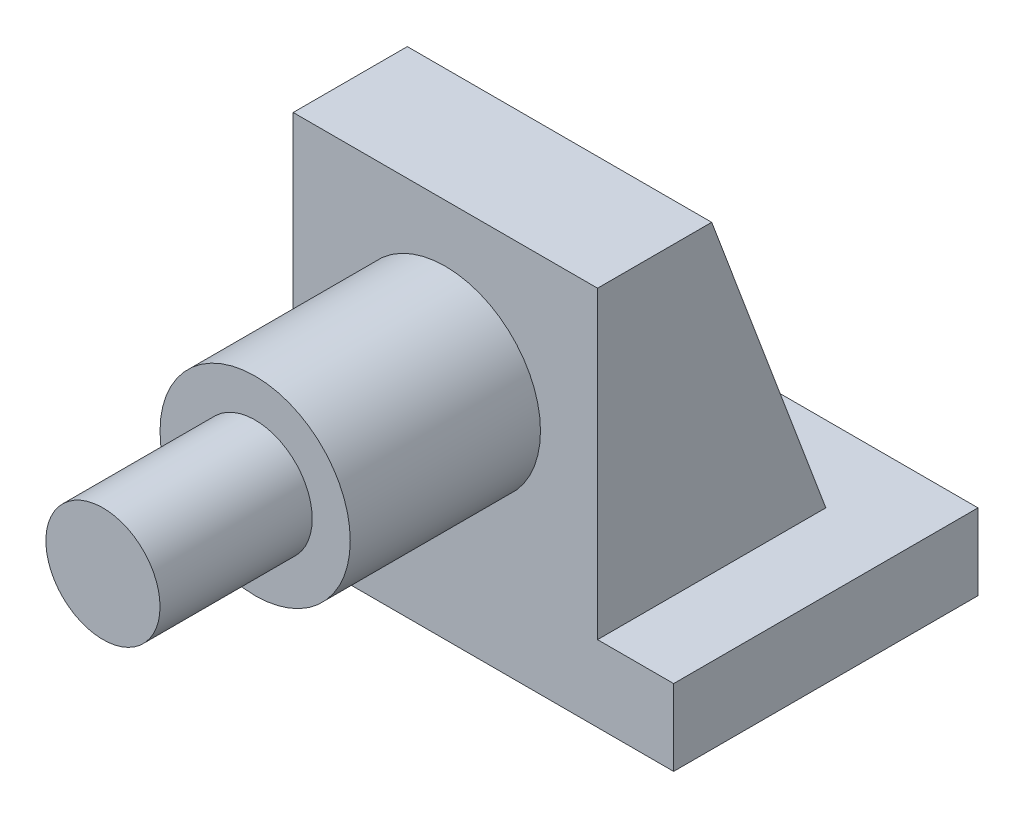
ISO-10303-21;
HEADER;
FILE_DESCRIPTION(('STEP AP214'),'2;1');
FILE_NAME('part.step','',(''),(''),'','','');
FILE_SCHEMA(('AUTOMOTIVE_DESIGN { 1 0 10303 214 1 1 1 1 }'));
ENDSEC;
DATA;
#1=APPLICATION_CONTEXT('core data for automotive mechanical design processes');
#2=APPLICATION_PROTOCOL_DEFINITION('international standard','automotive_design',2000,#1);
#3=PRODUCT_CONTEXT('',#1,'mechanical');
#4=PRODUCT('Part','Part','',(#3));
#5=PRODUCT_RELATED_PRODUCT_CATEGORY('part','',(#4));
#6=PRODUCT_DEFINITION_FORMATION('','',#4);
#7=PRODUCT_DEFINITION_CONTEXT('part definition',#1,'design');
#8=PRODUCT_DEFINITION('design','',#6,#7);
#9=PRODUCT_DEFINITION_SHAPE('','',#8);
#10=(LENGTH_UNIT() NAMED_UNIT(*) SI_UNIT(.MILLI.,.METRE.));
#11=(NAMED_UNIT(*) PLANE_ANGLE_UNIT() SI_UNIT($,.RADIAN.));
#12=(NAMED_UNIT(*) SI_UNIT($,.STERADIAN.) SOLID_ANGLE_UNIT());
#13=UNCERTAINTY_MEASURE_WITH_UNIT(LENGTH_MEASURE(1.E-05),#10,'distance_accuracy_value','');
#14=(GEOMETRIC_REPRESENTATION_CONTEXT(3) GLOBAL_UNCERTAINTY_ASSIGNED_CONTEXT((#13)) GLOBAL_UNIT_ASSIGNED_CONTEXT((#10,
#11,#12)) REPRESENTATION_CONTEXT('',''));
#15=CARTESIAN_POINT('',(0.,0.,0.));
#16=DIRECTION('',(0.,0.,1.));
#17=DIRECTION('',(1.,0.,0.));
#18=AXIS2_PLACEMENT_3D('',#15,#16,#17);
#19=CARTESIAN_POINT('',(0.,0.,65.));
#20=DIRECTION('',(0.,0.,1.));
#21=DIRECTION('',(1.,0.,0.));
#22=AXIS2_PLACEMENT_3D('',#19,#20,#21);
#23=PLANE('',#22);
#24=CARTESIAN_POINT('',(0.,0.,65.));
#25=DIRECTION('',(0.,0.,1.));
#26=DIRECTION('',(1.,0.,0.));
#27=AXIS2_PLACEMENT_3D('',#24,#25,#26);
#28=CIRCLE('',#27,12.5);
#29=CARTESIAN_POINT('',(12.5,0.,65.));
#30=VERTEX_POINT('',#29);
#31=EDGE_CURVE('E158',#30,#30,#28,.T.);
#32=ORIENTED_EDGE('',*,*,#31,.T.);
#33=EDGE_LOOP('',(#32));
#34=FACE_BOUND('',#33,.T.);
#35=CARTESIAN_POINT('',(0.,0.,65.));
#36=DIRECTION('',(0.,0.,1.));
#37=DIRECTION('',(1.,0.,0.));
#38=AXIS2_PLACEMENT_3D('',#35,#36,#37);
#39=CIRCLE('',#38,7.5);
#40=CARTESIAN_POINT('',(7.5,0.,65.));
#41=VERTEX_POINT('',#40);
#42=EDGE_CURVE('E219',#41,#41,#39,.T.);
#43=ORIENTED_EDGE('',*,*,#42,.F.);
#44=EDGE_LOOP('',(#43));
#45=FACE_BOUND('',#44,.T.);
#46=ADVANCED_FACE('F34',(#34,#45),#23,.T.);
#47=CARTESIAN_POINT('',(0.,0.,40.));
#48=DIRECTION('',(0.,0.,1.));
#49=DIRECTION('',(1.,0.,0.));
#50=AXIS2_PLACEMENT_3D('',#47,#48,#49);
#51=PLANE('',#50);
#52=DIRECTION('',(-1.,0.,0.));
#53=VECTOR('',#52,1.);
#54=CARTESIAN_POINT('',(30.,-20.,40.));
#55=LINE('',#54,#53);
#56=CARTESIAN_POINT('',(30.,-20.,40.));
#57=VERTEX_POINT('',#56);
#58=CARTESIAN_POINT('',(20.,-20.,40.));
#59=VERTEX_POINT('',#58);
#60=EDGE_CURVE('E130',#57,#59,#55,.T.);
#61=ORIENTED_EDGE('',*,*,#60,.T.);
#62=DIRECTION('',(0.,1.,0.));
#63=VECTOR('',#62,1.);
#64=CARTESIAN_POINT('',(20.,20.,40.));
#65=LINE('',#64,#63);
#66=CARTESIAN_POINT('',(20.,20.,40.));
#67=VERTEX_POINT('',#66);
#68=EDGE_CURVE('E84',#59,#67,#65,.T.);
#69=ORIENTED_EDGE('',*,*,#68,.T.);
#70=DIRECTION('',(-1.,0.,0.));
#71=VECTOR('',#70,1.);
#72=CARTESIAN_POINT('',(-20.,20.,40.));
#73=LINE('',#72,#71);
#74=CARTESIAN_POINT('',(-20.,20.,40.));
#75=VERTEX_POINT('',#74);
#76=EDGE_CURVE('E150',#67,#75,#73,.T.);
#77=ORIENTED_EDGE('',*,*,#76,.T.);
#78=DIRECTION('',(0.,-1.,0.));
#79=VECTOR('',#78,1.);
#80=CARTESIAN_POINT('',(-20.,20.,40.));
#81=LINE('',#80,#79);
#82=CARTESIAN_POINT('',(-20.,-20.,40.));
#83=VERTEX_POINT('',#82);
#84=EDGE_CURVE('E173',#75,#83,#81,.T.);
#85=ORIENTED_EDGE('',*,*,#84,.T.);
#86=DIRECTION('',(-1.,0.,0.));
#87=VECTOR('',#86,1.);
#88=CARTESIAN_POINT('',(-20.,-20.,40.));
#89=LINE('',#88,#87);
#90=CARTESIAN_POINT('',(-30.,-20.,40.));
#91=VERTEX_POINT('',#90);
#92=EDGE_CURVE('E107',#83,#91,#89,.T.);
#93=ORIENTED_EDGE('',*,*,#92,.T.);
#94=DIRECTION('',(0.,-1.,0.));
#95=VECTOR('',#94,1.);
#96=CARTESIAN_POINT('',(-30.,-30.,40.));
#97=LINE('',#96,#95);
#98=CARTESIAN_POINT('',(-30.,-30.,40.));
#99=VERTEX_POINT('',#98);
#100=EDGE_CURVE('E100',#91,#99,#97,.T.);
#101=ORIENTED_EDGE('',*,*,#100,.T.);
#102=DIRECTION('',(1.,0.,0.));
#103=VECTOR('',#102,1.);
#104=CARTESIAN_POINT('',(30.,-30.,40.));
#105=LINE('',#104,#103);
#106=CARTESIAN_POINT('',(30.,-30.,40.));
#107=VERTEX_POINT('',#106);
#108=EDGE_CURVE('E105',#99,#107,#105,.T.);
#109=ORIENTED_EDGE('',*,*,#108,.T.);
#110=DIRECTION('',(0.,1.,0.));
#111=VECTOR('',#110,1.);
#112=CARTESIAN_POINT('',(30.,-30.,40.));
#113=LINE('',#112,#111);
#114=EDGE_CURVE('E51',#107,#57,#113,.T.);
#115=ORIENTED_EDGE('',*,*,#114,.T.);
#116=EDGE_LOOP('',(#61,#69,#77,#85,#93,#101,#109,#115));
#117=FACE_BOUND('',#116,.T.);
#118=CARTESIAN_POINT('',(0.,0.,40.));
#119=DIRECTION('',(0.,0.,1.));
#120=DIRECTION('',(1.,0.,0.));
#121=AXIS2_PLACEMENT_3D('',#118,#119,#120);
#122=CIRCLE('',#121,12.5);
#123=CARTESIAN_POINT('',(12.5,0.,40.));
#124=VERTEX_POINT('',#123);
#125=EDGE_CURVE('E163',#124,#124,#122,.T.);
#126=ORIENTED_EDGE('',*,*,#125,.F.);
#127=EDGE_LOOP('',(#126));
#128=FACE_BOUND('',#127,.T.);
#129=ADVANCED_FACE('F102',(#117,#128),#51,.T.);
#130=CARTESIAN_POINT('',(20.,20.,40.));
#131=DIRECTION('',(-1.,0.,0.));
#132=DIRECTION('',(0.,-1.,0.));
#133=AXIS2_PLACEMENT_3D('',#130,#131,#132);
#134=PLANE('',#133);
#135=DIRECTION('',(0.,0.,-1.));
#136=VECTOR('',#135,1.);
#137=CARTESIAN_POINT('',(20.,-20.,40.));
#138=LINE('',#137,#136);
#139=CARTESIAN_POINT('',(20.,-20.,10.));
#140=VERTEX_POINT('',#139);
#141=EDGE_CURVE('E11',#59,#140,#138,.T.);
#142=ORIENTED_EDGE('',*,*,#141,.T.);
#143=DIRECTION('',(0.,-0.936329177569044,-0.351123441588392));
#144=VECTOR('',#143,1.);
#145=CARTESIAN_POINT('',(20.,-20.,10.));
#146=LINE('',#145,#144);
#147=CARTESIAN_POINT('',(20.,20.,25.));
#148=VERTEX_POINT('',#147);
#149=EDGE_CURVE('E153',#148,#140,#146,.T.);
#150=ORIENTED_EDGE('',*,*,#149,.F.);
#151=DIRECTION('',(0.,0.,-1.));
#152=VECTOR('',#151,1.);
#153=CARTESIAN_POINT('',(20.,20.,40.));
#154=LINE('',#153,#152);
#155=EDGE_CURVE('E43',#67,#148,#154,.T.);
#156=ORIENTED_EDGE('',*,*,#155,.F.);
#157=ORIENTED_EDGE('',*,*,#68,.F.);
#158=EDGE_LOOP('',(#142,#150,#156,#157));
#159=FACE_BOUND('',#158,.T.);
#160=ADVANCED_FACE('F36',(#159),#134,.F.);
#161=CARTESIAN_POINT('',(-20.,20.,40.));
#162=DIRECTION('',(0.,-1.,0.));
#163=DIRECTION('',(0.,0.,-1.));
#164=AXIS2_PLACEMENT_3D('',#161,#162,#163);
#165=PLANE('',#164);
#166=ORIENTED_EDGE('',*,*,#155,.T.);
#167=DIRECTION('',(1.,0.,0.));
#168=VECTOR('',#167,1.);
#169=CARTESIAN_POINT('',(-20.,20.,25.));
#170=LINE('',#169,#168);
#171=CARTESIAN_POINT('',(-20.,20.,25.));
#172=VERTEX_POINT('',#171);
#173=EDGE_CURVE('E149',#172,#148,#170,.T.);
#174=ORIENTED_EDGE('',*,*,#173,.F.);
#175=DIRECTION('',(0.,0.,-1.));
#176=VECTOR('',#175,1.);
#177=CARTESIAN_POINT('',(-20.,20.,40.));
#178=LINE('',#177,#176);
#179=EDGE_CURVE('E138',#75,#172,#178,.T.);
#180=ORIENTED_EDGE('',*,*,#179,.F.);
#181=ORIENTED_EDGE('',*,*,#76,.F.);
#182=EDGE_LOOP('',(#166,#174,#180,#181));
#183=FACE_BOUND('',#182,.T.);
#184=ADVANCED_FACE('F145',(#183),#165,.F.);
#185=CARTESIAN_POINT('',(-20.,20.,40.));
#186=DIRECTION('',(1.,0.,0.));
#187=DIRECTION('',(0.,1.,0.));
#188=AXIS2_PLACEMENT_3D('',#185,#186,#187);
#189=PLANE('',#188);
#190=ORIENTED_EDGE('',*,*,#179,.T.);
#191=DIRECTION('',(0.,-0.936329177569044,-0.351123441588392));
#192=VECTOR('',#191,1.);
#193=CARTESIAN_POINT('',(-20.,-20.,10.));
#194=LINE('',#193,#192);
#195=CARTESIAN_POINT('',(-20.,-20.,10.));
#196=VERTEX_POINT('',#195);
#197=EDGE_CURVE('E157',#172,#196,#194,.T.);
#198=ORIENTED_EDGE('',*,*,#197,.T.);
#199=DIRECTION('',(0.,0.,-1.));
#200=VECTOR('',#199,1.);
#201=CARTESIAN_POINT('',(-20.,-20.,40.));
#202=LINE('',#201,#200);
#203=EDGE_CURVE('E135',#83,#196,#202,.T.);
#204=ORIENTED_EDGE('',*,*,#203,.F.);
#205=ORIENTED_EDGE('',*,*,#84,.F.);
#206=EDGE_LOOP('',(#190,#198,#204,#205));
#207=FACE_BOUND('',#206,.T.);
#208=ADVANCED_FACE('F177',(#207),#189,.F.);
#209=CARTESIAN_POINT('',(-20.,-20.,40.));
#210=DIRECTION('',(0.,-1.,0.));
#211=DIRECTION('',(1.,0.,0.));
#212=AXIS2_PLACEMENT_3D('',#209,#210,#211);
#213=PLANE('',#212);
#214=DIRECTION('',(-1.,0.,0.));
#215=VECTOR('',#214,1.);
#216=CARTESIAN_POINT('',(-20.,-20.,0.));
#217=LINE('',#216,#215);
#218=CARTESIAN_POINT('',(30.,-20.,0.));
#219=VERTEX_POINT('',#218);
#220=CARTESIAN_POINT('',(-30.,-20.,0.));
#221=VERTEX_POINT('',#220);
#222=EDGE_CURVE('E76',#219,#221,#217,.T.);
#223=ORIENTED_EDGE('',*,*,#222,.T.);
#224=DIRECTION('',(0.,0.,-1.));
#225=VECTOR('',#224,1.);
#226=CARTESIAN_POINT('',(-30.,-20.,40.));
#227=LINE('',#226,#225);
#228=EDGE_CURVE('E115',#91,#221,#227,.T.);
#229=ORIENTED_EDGE('',*,*,#228,.F.);
#230=ORIENTED_EDGE('',*,*,#92,.F.);
#231=ORIENTED_EDGE('',*,*,#203,.T.);
#232=DIRECTION('',(1.,0.,0.));
#233=VECTOR('',#232,1.);
#234=CARTESIAN_POINT('',(-20.,-20.,10.));
#235=LINE('',#234,#233);
#236=EDGE_CURVE('E125',#196,#140,#235,.T.);
#237=ORIENTED_EDGE('',*,*,#236,.T.);
#238=ORIENTED_EDGE('',*,*,#141,.F.);
#239=ORIENTED_EDGE('',*,*,#60,.F.);
#240=DIRECTION('',(0.,0.,-1.));
#241=VECTOR('',#240,1.);
#242=CARTESIAN_POINT('',(30.,-20.,40.));
#243=LINE('',#242,#241);
#244=EDGE_CURVE('E120',#57,#219,#243,.T.);
#245=ORIENTED_EDGE('',*,*,#244,.T.);
#246=EDGE_LOOP('',(#223,#229,#230,#231,#237,#238,#239,#245));
#247=FACE_BOUND('',#246,.T.);
#248=ADVANCED_FACE('F180',(#247),#213,.F.);
#249=CARTESIAN_POINT('',(-30.,-30.,40.));
#250=DIRECTION('',(1.,0.,0.));
#251=DIRECTION('',(0.,0.,-1.));
#252=AXIS2_PLACEMENT_3D('',#249,#250,#251);
#253=PLANE('',#252);
#254=DIRECTION('',(0.,-1.,0.));
#255=VECTOR('',#254,1.);
#256=CARTESIAN_POINT('',(-30.,-30.,0.));
#257=LINE('',#256,#255);
#258=CARTESIAN_POINT('',(-30.,-30.,0.));
#259=VERTEX_POINT('',#258);
#260=EDGE_CURVE('E114',#221,#259,#257,.T.);
#261=ORIENTED_EDGE('',*,*,#260,.T.);
#262=DIRECTION('',(0.,0.,-1.));
#263=VECTOR('',#262,1.);
#264=CARTESIAN_POINT('',(-30.,-30.,40.));
#265=LINE('',#264,#263);
#266=EDGE_CURVE('E112',#99,#259,#265,.T.);
#267=ORIENTED_EDGE('',*,*,#266,.F.);
#268=ORIENTED_EDGE('',*,*,#100,.F.);
#269=ORIENTED_EDGE('',*,*,#228,.T.);
#270=EDGE_LOOP('',(#261,#267,#268,#269));
#271=FACE_BOUND('',#270,.T.);
#272=ADVANCED_FACE('F113',(#271),#253,.F.);
#273=CARTESIAN_POINT('',(30.,-30.,40.));
#274=DIRECTION('',(0.,1.,0.));
#275=DIRECTION('',(-1.,0.,0.));
#276=AXIS2_PLACEMENT_3D('',#273,#274,#275);
#277=PLANE('',#276);
#278=DIRECTION('',(1.,0.,0.));
#279=VECTOR('',#278,1.);
#280=CARTESIAN_POINT('',(30.,-30.,0.));
#281=LINE('',#280,#279);
#282=CARTESIAN_POINT('',(30.,-30.,0.));
#283=VERTEX_POINT('',#282);
#284=EDGE_CURVE('E69',#259,#283,#281,.T.);
#285=ORIENTED_EDGE('',*,*,#284,.T.);
#286=DIRECTION('',(0.,0.,-1.));
#287=VECTOR('',#286,1.);
#288=CARTESIAN_POINT('',(30.,-30.,40.));
#289=LINE('',#288,#287);
#290=EDGE_CURVE('E116',#107,#283,#289,.T.);
#291=ORIENTED_EDGE('',*,*,#290,.F.);
#292=ORIENTED_EDGE('',*,*,#108,.F.);
#293=ORIENTED_EDGE('',*,*,#266,.T.);
#294=EDGE_LOOP('',(#285,#291,#292,#293));
#295=FACE_BOUND('',#294,.T.);
#296=ADVANCED_FACE('F118',(#295),#277,.F.);
#297=CARTESIAN_POINT('',(30.,-30.,40.));
#298=DIRECTION('',(-1.,0.,0.));
#299=DIRECTION('',(0.,0.,1.));
#300=AXIS2_PLACEMENT_3D('',#297,#298,#299);
#301=PLANE('',#300);
#302=DIRECTION('',(0.,1.,0.));
#303=VECTOR('',#302,1.);
#304=CARTESIAN_POINT('',(30.,-30.,0.));
#305=LINE('',#304,#303);
#306=EDGE_CURVE('E128',#283,#219,#305,.T.);
#307=ORIENTED_EDGE('',*,*,#306,.T.);
#308=ORIENTED_EDGE('',*,*,#244,.F.);
#309=ORIENTED_EDGE('',*,*,#114,.F.);
#310=ORIENTED_EDGE('',*,*,#290,.T.);
#311=EDGE_LOOP('',(#307,#308,#309,#310));
#312=FACE_BOUND('',#311,.T.);
#313=ADVANCED_FACE('F183',(#312),#301,.F.);
#314=CARTESIAN_POINT('',(0.,0.,0.));
#315=DIRECTION('',(0.,0.,1.));
#316=DIRECTION('',(1.,0.,0.));
#317=AXIS2_PLACEMENT_3D('',#314,#315,#316);
#318=PLANE('',#317);
#319=ORIENTED_EDGE('',*,*,#222,.F.);
#320=ORIENTED_EDGE('',*,*,#306,.F.);
#321=ORIENTED_EDGE('',*,*,#284,.F.);
#322=ORIENTED_EDGE('',*,*,#260,.F.);
#323=EDGE_LOOP('',(#319,#320,#321,#322));
#324=FACE_BOUND('',#323,.T.);
#325=ADVANCED_FACE('F181',(#324),#318,.F.);
#326=CARTESIAN_POINT('',(-20.,-20.,10.));
#327=DIRECTION('',(0.,-0.351123441588392,0.936329177569045));
#328=DIRECTION('',(0.,-0.936329177569045,-0.351123441588392));
#329=AXIS2_PLACEMENT_3D('',#326,#327,#328);
#330=PLANE('',#329);
#331=ORIENTED_EDGE('',*,*,#149,.T.);
#332=ORIENTED_EDGE('',*,*,#236,.F.);
#333=ORIENTED_EDGE('',*,*,#197,.F.);
#334=ORIENTED_EDGE('',*,*,#173,.T.);
#335=EDGE_LOOP('',(#331,#332,#333,#334));
#336=FACE_BOUND('',#335,.T.);
#337=ADVANCED_FACE('F185',(#336),#330,.F.);
#338=CARTESIAN_POINT('',(0.,0.,65.));
#339=DIRECTION('',(0.,0.,-1.));
#340=DIRECTION('',(-1.,0.,0.));
#341=AXIS2_PLACEMENT_3D('',#338,#339,#340);
#342=CYLINDRICAL_SURFACE('',#341,12.5);
#343=ORIENTED_EDGE('',*,*,#31,.F.);
#344=EDGE_LOOP('',(#343));
#345=FACE_BOUND('',#344,.T.);
#346=ORIENTED_EDGE('',*,*,#125,.T.);
#347=EDGE_LOOP('',(#346));
#348=FACE_BOUND('',#347,.T.);
#349=ADVANCED_FACE('F189',(#345,#348),#342,.T.);
#350=CARTESIAN_POINT('',(0.,0.,85.));
#351=DIRECTION('',(0.,0.,-1.));
#352=DIRECTION('',(-1.,0.,0.));
#353=AXIS2_PLACEMENT_3D('',#350,#351,#352);
#354=CYLINDRICAL_SURFACE('',#353,7.5);
#355=CARTESIAN_POINT('',(0.,0.,85.));
#356=DIRECTION('',(0.,0.,1.));
#357=DIRECTION('',(1.,0.,0.));
#358=AXIS2_PLACEMENT_3D('',#355,#356,#357);
#359=CIRCLE('',#358,7.5);
#360=CARTESIAN_POINT('',(7.5,0.,85.));
#361=VERTEX_POINT('',#360);
#362=EDGE_CURVE('E218',#361,#361,#359,.T.);
#363=ORIENTED_EDGE('',*,*,#362,.F.);
#364=EDGE_LOOP('',(#363));
#365=FACE_BOUND('',#364,.T.);
#366=ORIENTED_EDGE('',*,*,#42,.T.);
#367=EDGE_LOOP('',(#366));
#368=FACE_BOUND('',#367,.T.);
#369=ADVANCED_FACE('F195',(#365,#368),#354,.T.);
#370=CARTESIAN_POINT('',(0.,0.,85.));
#371=DIRECTION('',(0.,0.,1.));
#372=DIRECTION('',(1.,0.,0.));
#373=AXIS2_PLACEMENT_3D('',#370,#371,#372);
#374=PLANE('',#373);
#375=ORIENTED_EDGE('',*,*,#362,.T.);
#376=EDGE_LOOP('',(#375));
#377=FACE_BOUND('',#376,.T.);
#378=ADVANCED_FACE('F210',(#377),#374,.T.);
#379=CLOSED_SHELL('',(#46,#129,#160,#184,#208,#248,#272,#296,#313,#325,#337,#349,#369,#378));
#380=MANIFOLD_SOLID_BREP('B2',#379);
#381=ADVANCED_BREP_SHAPE_REPRESENTATION('',(#18,#380),#14);
#382=SHAPE_DEFINITION_REPRESENTATION(#9,#381);
ENDSEC;
END-ISO-10303-21;
